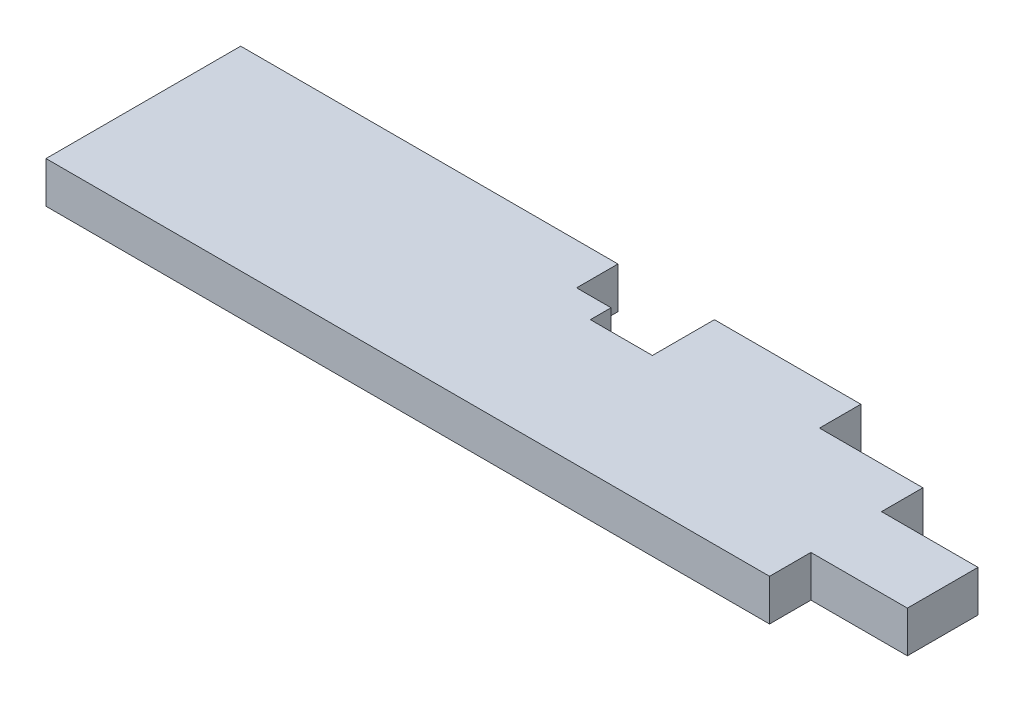
ISO-10303-21;
HEADER;
FILE_DESCRIPTION(('STEP AP214'),'2;1');
FILE_NAME('part.step','',(''),(''),'','','');
FILE_SCHEMA(('AUTOMOTIVE_DESIGN { 1 0 10303 214 1 1 1 1 }'));
ENDSEC;
DATA;
#1=APPLICATION_CONTEXT('core data for automotive mechanical design processes');
#2=APPLICATION_PROTOCOL_DEFINITION('international standard','automotive_design',2000,#1);
#3=PRODUCT_CONTEXT('',#1,'mechanical');
#4=PRODUCT('Part','Part','',(#3));
#5=PRODUCT_RELATED_PRODUCT_CATEGORY('part','',(#4));
#6=PRODUCT_DEFINITION_FORMATION('','',#4);
#7=PRODUCT_DEFINITION_CONTEXT('part definition',#1,'design');
#8=PRODUCT_DEFINITION('design','',#6,#7);
#9=PRODUCT_DEFINITION_SHAPE('','',#8);
#10=(LENGTH_UNIT() NAMED_UNIT(*) SI_UNIT(.MILLI.,.METRE.));
#11=(NAMED_UNIT(*) PLANE_ANGLE_UNIT() SI_UNIT($,.RADIAN.));
#12=(NAMED_UNIT(*) SI_UNIT($,.STERADIAN.) SOLID_ANGLE_UNIT());
#13=UNCERTAINTY_MEASURE_WITH_UNIT(LENGTH_MEASURE(1.E-05),#10,'distance_accuracy_value','');
#14=(GEOMETRIC_REPRESENTATION_CONTEXT(3) GLOBAL_UNCERTAINTY_ASSIGNED_CONTEXT((#13)) GLOBAL_UNIT_ASSIGNED_CONTEXT((#10,
#11,#12)) REPRESENTATION_CONTEXT('',''));
#15=CARTESIAN_POINT('',(0.,0.,0.));
#16=DIRECTION('',(0.,0.,1.));
#17=DIRECTION('',(1.,0.,0.));
#18=AXIS2_PLACEMENT_3D('',#15,#16,#17);
#19=CARTESIAN_POINT('',(0.,38.1,-179.3875));
#20=DIRECTION('',(0.,0.,1.));
#21=DIRECTION('',(1.,0.,0.));
#22=AXIS2_PLACEMENT_3D('',#19,#20,#21);
#23=PLANE('',#22);
#24=DIRECTION('',(0.,-1.,0.));
#25=VECTOR('',#24,1.);
#26=CARTESIAN_POINT('',(436.55104079,38.1,-179.3875));
#27=LINE('',#26,#25);
#28=CARTESIAN_POINT('',(436.55104079,38.1,-179.3875));
#29=VERTEX_POINT('',#28);
#30=CARTESIAN_POINT('',(436.55104079,0.,-179.3875));
#31=VERTEX_POINT('',#30);
#32=EDGE_CURVE('E245',#29,#31,#27,.T.);
#33=ORIENTED_EDGE('',*,*,#32,.F.);
#34=DIRECTION('',(-1.,0.,0.));
#35=VECTOR('',#34,1.);
#36=CARTESIAN_POINT('',(0.,38.1,-179.3875));
#37=LINE('',#36,#35);
#38=CARTESIAN_POINT('',(571.5,38.1,-179.3875));
#39=VERTEX_POINT('',#38);
#40=EDGE_CURVE('E202',#39,#29,#37,.T.);
#41=ORIENTED_EDGE('',*,*,#40,.F.);
#42=DIRECTION('',(0.,-1.,0.));
#43=VECTOR('',#42,1.);
#44=CARTESIAN_POINT('',(571.5,38.1,-179.3875));
#45=LINE('',#44,#43);
#46=CARTESIAN_POINT('',(571.5,0.,-179.3875));
#47=VERTEX_POINT('',#46);
#48=EDGE_CURVE('E186',#39,#47,#45,.T.);
#49=ORIENTED_EDGE('',*,*,#48,.T.);
#50=DIRECTION('',(-1.,0.,0.));
#51=VECTOR('',#50,1.);
#52=CARTESIAN_POINT('',(0.,0.,-179.3875));
#53=LINE('',#52,#51);
#54=EDGE_CURVE('E197',#47,#31,#53,.T.);
#55=ORIENTED_EDGE('',*,*,#54,.T.);
#56=EDGE_LOOP('',(#33,#41,#49,#55));
#57=FACE_BOUND('',#56,.T.);
#58=ADVANCED_FACE('F38',(#57),#23,.F.);
#59=DIRECTION('',(0.,-1.,0.));
#60=VECTOR('',#59,1.);
#61=CARTESIAN_POINT('',(347.662499999998,38.1,-179.3875));
#62=LINE('',#61,#60);
#63=CARTESIAN_POINT('',(347.662499999998,38.1,-179.3875));
#64=VERTEX_POINT('',#63);
#65=CARTESIAN_POINT('',(347.662499999998,0.,-179.3875));
#66=VERTEX_POINT('',#65);
#67=EDGE_CURVE('E242',#64,#66,#62,.T.);
#68=ORIENTED_EDGE('',*,*,#67,.T.);
#69=CARTESIAN_POINT('',(0.,0.,-179.3875));
#70=VERTEX_POINT('',#69);
#71=EDGE_CURVE('E212',#66,#70,#53,.T.);
#72=ORIENTED_EDGE('',*,*,#71,.T.);
#73=DIRECTION('',(0.,-1.,0.));
#74=VECTOR('',#73,1.);
#75=CARTESIAN_POINT('',(0.,38.1,-179.3875));
#76=LINE('',#75,#74);
#77=CARTESIAN_POINT('',(0.,38.1,-179.3875));
#78=VERTEX_POINT('',#77);
#79=EDGE_CURVE('E205',#78,#70,#76,.T.);
#80=ORIENTED_EDGE('',*,*,#79,.F.);
#81=EDGE_CURVE('E201',#64,#78,#37,.T.);
#82=ORIENTED_EDGE('',*,*,#81,.F.);
#83=EDGE_LOOP('',(#68,#72,#80,#82));
#84=FACE_BOUND('',#83,.T.);
#85=ADVANCED_FACE('F240',(#84),#23,.F.);
#86=CARTESIAN_POINT('',(0.,38.1,0.));
#87=DIRECTION('',(0.,-1.,0.));
#88=DIRECTION('',(0.,0.,-1.));
#89=AXIS2_PLACEMENT_3D('',#86,#87,#88);
#90=PLANE('',#89);
#91=DIRECTION('',(-1.,0.,0.));
#92=VECTOR('',#91,1.);
#93=CARTESIAN_POINT('',(755.65,38.1,-103.1875));
#94=LINE('',#93,#92);
#95=CARTESIAN_POINT('',(755.65,38.1,-103.1875));
#96=VERTEX_POINT('',#95);
#97=CARTESIAN_POINT('',(666.75,38.1,-103.1875));
#98=VERTEX_POINT('',#97);
#99=EDGE_CURVE('E150',#96,#98,#94,.T.);
#100=ORIENTED_EDGE('',*,*,#99,.T.);
#101=DIRECTION('',(0.,0.,-1.));
#102=VECTOR('',#101,1.);
#103=CARTESIAN_POINT('',(666.75,38.1,-141.2875));
#104=LINE('',#103,#102);
#105=CARTESIAN_POINT('',(666.75,38.1,-141.2875));
#106=VERTEX_POINT('',#105);
#107=EDGE_CURVE('E161',#98,#106,#104,.T.);
#108=ORIENTED_EDGE('',*,*,#107,.T.);
#109=DIRECTION('',(-1.,0.,0.));
#110=VECTOR('',#109,1.);
#111=CARTESIAN_POINT('',(755.65,38.1,-141.2875));
#112=LINE('',#111,#110);
#113=CARTESIAN_POINT('',(571.5,38.1,-141.2875));
#114=VERTEX_POINT('',#113);
#115=EDGE_CURVE('E258',#106,#114,#112,.T.);
#116=ORIENTED_EDGE('',*,*,#115,.T.);
#117=DIRECTION('',(0.,0.,-1.));
#118=VECTOR('',#117,1.);
#119=CARTESIAN_POINT('',(571.5,38.1,-179.3875));
#120=LINE('',#119,#118);
#121=EDGE_CURVE('E260',#114,#39,#120,.T.);
#122=ORIENTED_EDGE('',*,*,#121,.T.);
#123=ORIENTED_EDGE('',*,*,#40,.T.);
#124=DIRECTION('',(0.,0.,-1.));
#125=VECTOR('',#124,1.);
#126=CARTESIAN_POINT('',(436.55104079,38.1,4.24032385747234E-13));
#127=LINE('',#126,#125);
#128=CARTESIAN_POINT('',(436.55104079,38.1,-122.237499999995));
#129=VERTEX_POINT('',#128);
#130=EDGE_CURVE('E257',#129,#29,#127,.T.);
#131=ORIENTED_EDGE('',*,*,#130,.F.);
#132=DIRECTION('',(-1.,0.,0.));
#133=VECTOR('',#132,1.);
#134=CARTESIAN_POINT('',(0.,38.1,-122.237499999995));
#135=LINE('',#134,#133);
#136=CARTESIAN_POINT('',(379.412499999998,38.1,-122.237499999995));
#137=VERTEX_POINT('',#136);
#138=EDGE_CURVE('E295',#129,#137,#135,.T.);
#139=ORIENTED_EDGE('',*,*,#138,.T.);
#140=DIRECTION('',(0.,0.,-1.));
#141=VECTOR('',#140,1.);
#142=CARTESIAN_POINT('',(379.412499999998,38.1,0.));
#143=LINE('',#142,#141);
#144=CARTESIAN_POINT('',(379.412499999998,38.1,-141.287499999995));
#145=VERTEX_POINT('',#144);
#146=EDGE_CURVE('E297',#137,#145,#143,.T.);
#147=ORIENTED_EDGE('',*,*,#146,.T.);
#148=DIRECTION('',(-1.,0.,0.));
#149=VECTOR('',#148,1.);
#150=CARTESIAN_POINT('',(0.,38.1,-141.287499999995));
#151=LINE('',#150,#149);
#152=CARTESIAN_POINT('',(347.662499999998,38.1,-141.287499999995));
#153=VERTEX_POINT('',#152);
#154=EDGE_CURVE('E300',#145,#153,#151,.T.);
#155=ORIENTED_EDGE('',*,*,#154,.T.);
#156=DIRECTION('',(0.,0.,1.));
#157=VECTOR('',#156,1.);
#158=CARTESIAN_POINT('',(347.662499999998,38.1,5.06539254985153E-13));
#159=LINE('',#158,#157);
#160=EDGE_CURVE('E303',#64,#153,#159,.T.);
#161=ORIENTED_EDGE('',*,*,#160,.F.);
#162=ORIENTED_EDGE('',*,*,#81,.T.);
#163=DIRECTION('',(0.,0.,1.));
#164=VECTOR('',#163,1.);
#165=CARTESIAN_POINT('',(0.,38.1,0.));
#166=LINE('',#165,#164);
#167=CARTESIAN_POINT('',(0.,38.1,0.));
#168=VERTEX_POINT('',#167);
#169=EDGE_CURVE('E193',#78,#168,#166,.T.);
#170=ORIENTED_EDGE('',*,*,#169,.T.);
#171=DIRECTION('',(1.,0.,0.));
#172=VECTOR('',#171,1.);
#173=CARTESIAN_POINT('',(0.,38.1,0.));
#174=LINE('',#173,#172);
#175=CARTESIAN_POINT('',(666.75,38.1,0.));
#176=VERTEX_POINT('',#175);
#177=EDGE_CURVE('E196',#168,#176,#174,.T.);
#178=ORIENTED_EDGE('',*,*,#177,.T.);
#179=DIRECTION('',(0.,0.,-1.));
#180=VECTOR('',#179,1.);
#181=CARTESIAN_POINT('',(666.75,38.1,0.));
#182=LINE('',#181,#180);
#183=CARTESIAN_POINT('',(666.75,38.1,-38.1));
#184=VERTEX_POINT('',#183);
#185=EDGE_CURVE('E199',#176,#184,#182,.T.);
#186=ORIENTED_EDGE('',*,*,#185,.T.);
#187=DIRECTION('',(-1.,0.,0.));
#188=VECTOR('',#187,1.);
#189=CARTESIAN_POINT('',(666.75,38.1,-38.1));
#190=LINE('',#189,#188);
#191=CARTESIAN_POINT('',(755.65,38.1,-38.1));
#192=VERTEX_POINT('',#191);
#193=EDGE_CURVE('E175',#192,#184,#190,.T.);
#194=ORIENTED_EDGE('',*,*,#193,.F.);
#195=DIRECTION('',(0.,0.,1.));
#196=VECTOR('',#195,1.);
#197=CARTESIAN_POINT('',(755.65,38.1,-38.1));
#198=LINE('',#197,#196);
#199=EDGE_CURVE('E167',#96,#192,#198,.T.);
#200=ORIENTED_EDGE('',*,*,#199,.F.);
#201=EDGE_LOOP('',(#100,#108,#116,#122,#123,#131,#139,#147,#155,#161,#162,#170,#178,#186,#194,#200));
#202=FACE_BOUND('',#201,.T.);
#203=ADVANCED_FACE('F172',(#202),#90,.F.);
#204=CARTESIAN_POINT('',(0.,0.,0.));
#205=DIRECTION('',(0.,-1.,0.));
#206=DIRECTION('',(0.,0.,-1.));
#207=AXIS2_PLACEMENT_3D('',#204,#205,#206);
#208=PLANE('',#207);
#209=DIRECTION('',(0.,0.,-1.));
#210=VECTOR('',#209,1.);
#211=CARTESIAN_POINT('',(666.75,0.,-141.2875));
#212=LINE('',#211,#210);
#213=CARTESIAN_POINT('',(666.75,0.,-103.1875));
#214=VERTEX_POINT('',#213);
#215=CARTESIAN_POINT('',(666.75,0.,-141.2875));
#216=VERTEX_POINT('',#215);
#217=EDGE_CURVE('E53',#214,#216,#212,.T.);
#218=ORIENTED_EDGE('',*,*,#217,.F.);
#219=DIRECTION('',(-1.,0.,0.));
#220=VECTOR('',#219,1.);
#221=CARTESIAN_POINT('',(755.65,0.,-103.1875));
#222=LINE('',#221,#220);
#223=CARTESIAN_POINT('',(755.65,0.,-103.1875));
#224=VERTEX_POINT('',#223);
#225=EDGE_CURVE('E478',#224,#214,#222,.T.);
#226=ORIENTED_EDGE('',*,*,#225,.F.);
#227=DIRECTION('',(0.,0.,1.));
#228=VECTOR('',#227,1.);
#229=CARTESIAN_POINT('',(755.65,0.,-38.1));
#230=LINE('',#229,#228);
#231=CARTESIAN_POINT('',(755.65,0.,-38.1));
#232=VERTEX_POINT('',#231);
#233=EDGE_CURVE('E169',#224,#232,#230,.T.);
#234=ORIENTED_EDGE('',*,*,#233,.T.);
#235=DIRECTION('',(-1.,0.,0.));
#236=VECTOR('',#235,1.);
#237=CARTESIAN_POINT('',(666.75,0.,-38.1));
#238=LINE('',#237,#236);
#239=CARTESIAN_POINT('',(666.75,0.,-38.1));
#240=VERTEX_POINT('',#239);
#241=EDGE_CURVE('E176',#232,#240,#238,.T.);
#242=ORIENTED_EDGE('',*,*,#241,.T.);
#243=DIRECTION('',(0.,0.,-1.));
#244=VECTOR('',#243,1.);
#245=CARTESIAN_POINT('',(666.75,0.,0.));
#246=LINE('',#245,#244);
#247=CARTESIAN_POINT('',(666.75,0.,0.));
#248=VERTEX_POINT('',#247);
#249=EDGE_CURVE('E210',#248,#240,#246,.T.);
#250=ORIENTED_EDGE('',*,*,#249,.F.);
#251=DIRECTION('',(1.,0.,0.));
#252=VECTOR('',#251,1.);
#253=CARTESIAN_POINT('',(0.,0.,0.));
#254=LINE('',#253,#252);
#255=CARTESIAN_POINT('',(0.,0.,0.));
#256=VERTEX_POINT('',#255);
#257=EDGE_CURVE('E208',#256,#248,#254,.T.);
#258=ORIENTED_EDGE('',*,*,#257,.F.);
#259=DIRECTION('',(0.,0.,1.));
#260=VECTOR('',#259,1.);
#261=CARTESIAN_POINT('',(0.,0.,0.));
#262=LINE('',#261,#260);
#263=EDGE_CURVE('E191',#70,#256,#262,.T.);
#264=ORIENTED_EDGE('',*,*,#263,.F.);
#265=ORIENTED_EDGE('',*,*,#71,.F.);
#266=DIRECTION('',(0.,0.,1.));
#267=VECTOR('',#266,1.);
#268=CARTESIAN_POINT('',(347.662499999998,0.,5.06539254985153E-13));
#269=LINE('',#268,#267);
#270=CARTESIAN_POINT('',(347.662499999998,0.,-141.287499999995));
#271=VERTEX_POINT('',#270);
#272=EDGE_CURVE('E237',#66,#271,#269,.T.);
#273=ORIENTED_EDGE('',*,*,#272,.T.);
#274=DIRECTION('',(-1.,0.,0.));
#275=VECTOR('',#274,1.);
#276=CARTESIAN_POINT('',(0.,0.,-141.287499999995));
#277=LINE('',#276,#275);
#278=CARTESIAN_POINT('',(379.412499999998,0.,-141.287499999995));
#279=VERTEX_POINT('',#278);
#280=EDGE_CURVE('E308',#279,#271,#277,.T.);
#281=ORIENTED_EDGE('',*,*,#280,.F.);
#282=DIRECTION('',(0.,0.,-1.));
#283=VECTOR('',#282,1.);
#284=CARTESIAN_POINT('',(379.412499999998,0.,0.));
#285=LINE('',#284,#283);
#286=CARTESIAN_POINT('',(379.412499999998,0.,-122.237499999995));
#287=VERTEX_POINT('',#286);
#288=EDGE_CURVE('E289',#287,#279,#285,.T.);
#289=ORIENTED_EDGE('',*,*,#288,.F.);
#290=DIRECTION('',(-1.,0.,0.));
#291=VECTOR('',#290,1.);
#292=CARTESIAN_POINT('',(0.,0.,-122.237499999995));
#293=LINE('',#292,#291);
#294=CARTESIAN_POINT('',(436.55104079,0.,-122.237499999995));
#295=VERTEX_POINT('',#294);
#296=EDGE_CURVE('E61',#295,#287,#293,.T.);
#297=ORIENTED_EDGE('',*,*,#296,.F.);
#298=DIRECTION('',(0.,0.,-1.));
#299=VECTOR('',#298,1.);
#300=CARTESIAN_POINT('',(436.55104079,0.,4.24032385747234E-13));
#301=LINE('',#300,#299);
#302=EDGE_CURVE('E281',#295,#31,#301,.T.);
#303=ORIENTED_EDGE('',*,*,#302,.T.);
#304=ORIENTED_EDGE('',*,*,#54,.F.);
#305=DIRECTION('',(0.,0.,-1.));
#306=VECTOR('',#305,1.);
#307=CARTESIAN_POINT('',(571.5,0.,-179.3875));
#308=LINE('',#307,#306);
#309=CARTESIAN_POINT('',(571.5,0.,-141.2875));
#310=VERTEX_POINT('',#309);
#311=EDGE_CURVE('E261',#310,#47,#308,.T.);
#312=ORIENTED_EDGE('',*,*,#311,.F.);
#313=DIRECTION('',(-1.,0.,0.));
#314=VECTOR('',#313,1.);
#315=CARTESIAN_POINT('',(755.65,0.,-141.2875));
#316=LINE('',#315,#314);
#317=EDGE_CURVE('E264',#216,#310,#316,.T.);
#318=ORIENTED_EDGE('',*,*,#317,.F.);
#319=EDGE_LOOP('',(#218,#226,#234,#242,#250,#258,#264,#265,#273,#281,#289,#297,#303,#304,#312,#318));
#320=FACE_BOUND('',#319,.T.);
#321=ADVANCED_FACE('F224',(#320),#208,.T.);
#322=CARTESIAN_POINT('',(666.75,38.1,0.));
#323=DIRECTION('',(-1.,0.,0.));
#324=DIRECTION('',(0.,0.,1.));
#325=AXIS2_PLACEMENT_3D('',#322,#323,#324);
#326=PLANE('',#325);
#327=DIRECTION('',(0.,-1.,0.));
#328=VECTOR('',#327,1.);
#329=CARTESIAN_POINT('',(666.75,38.1,-38.1));
#330=LINE('',#329,#328);
#331=EDGE_CURVE('E188',#184,#240,#330,.T.);
#332=ORIENTED_EDGE('',*,*,#331,.F.);
#333=ORIENTED_EDGE('',*,*,#185,.F.);
#334=DIRECTION('',(0.,-1.,0.));
#335=VECTOR('',#334,1.);
#336=CARTESIAN_POINT('',(666.75,38.1,0.));
#337=LINE('',#336,#335);
#338=EDGE_CURVE('E46',#176,#248,#337,.T.);
#339=ORIENTED_EDGE('',*,*,#338,.T.);
#340=ORIENTED_EDGE('',*,*,#249,.T.);
#341=EDGE_LOOP('',(#332,#333,#339,#340));
#342=FACE_BOUND('',#341,.T.);
#343=ADVANCED_FACE('F221',(#342),#326,.F.);
#344=CARTESIAN_POINT('',(0.,38.1,0.));
#345=DIRECTION('',(1.,0.,0.));
#346=DIRECTION('',(0.,0.,-1.));
#347=AXIS2_PLACEMENT_3D('',#344,#345,#346);
#348=PLANE('',#347);
#349=ORIENTED_EDGE('',*,*,#263,.T.);
#350=DIRECTION('',(0.,-1.,0.));
#351=VECTOR('',#350,1.);
#352=CARTESIAN_POINT('',(0.,38.1,0.));
#353=LINE('',#352,#351);
#354=EDGE_CURVE('E11',#168,#256,#353,.T.);
#355=ORIENTED_EDGE('',*,*,#354,.F.);
#356=ORIENTED_EDGE('',*,*,#169,.F.);
#357=ORIENTED_EDGE('',*,*,#79,.T.);
#358=EDGE_LOOP('',(#349,#355,#356,#357));
#359=FACE_BOUND('',#358,.T.);
#360=ADVANCED_FACE('F40',(#359),#348,.F.);
#361=CARTESIAN_POINT('',(0.,38.1,0.));
#362=DIRECTION('',(0.,0.,-1.));
#363=DIRECTION('',(-1.,0.,0.));
#364=AXIS2_PLACEMENT_3D('',#361,#362,#363);
#365=PLANE('',#364);
#366=ORIENTED_EDGE('',*,*,#257,.T.);
#367=ORIENTED_EDGE('',*,*,#338,.F.);
#368=ORIENTED_EDGE('',*,*,#177,.F.);
#369=ORIENTED_EDGE('',*,*,#354,.T.);
#370=EDGE_LOOP('',(#366,#367,#368,#369));
#371=FACE_BOUND('',#370,.T.);
#372=ADVANCED_FACE('F231',(#371),#365,.F.);
#373=CARTESIAN_POINT('',(666.75,38.1,-38.1));
#374=DIRECTION('',(0.,0.,1.));
#375=DIRECTION('',(1.,0.,0.));
#376=AXIS2_PLACEMENT_3D('',#373,#374,#375);
#377=PLANE('',#376);
#378=ORIENTED_EDGE('',*,*,#241,.F.);
#379=DIRECTION('',(0.,-1.,0.));
#380=VECTOR('',#379,1.);
#381=CARTESIAN_POINT('',(755.65,38.1,-38.1));
#382=LINE('',#381,#380);
#383=EDGE_CURVE('E178',#192,#232,#382,.T.);
#384=ORIENTED_EDGE('',*,*,#383,.F.);
#385=ORIENTED_EDGE('',*,*,#193,.T.);
#386=ORIENTED_EDGE('',*,*,#331,.T.);
#387=EDGE_LOOP('',(#378,#384,#385,#386));
#388=FACE_BOUND('',#387,.T.);
#389=ADVANCED_FACE('F228',(#388),#377,.T.);
#390=CARTESIAN_POINT('',(755.65,38.1,-38.1));
#391=DIRECTION('',(1.,0.,0.));
#392=DIRECTION('',(0.,0.,-1.));
#393=AXIS2_PLACEMENT_3D('',#390,#391,#392);
#394=PLANE('',#393);
#395=DIRECTION('',(0.,-1.,0.));
#396=VECTOR('',#395,1.);
#397=CARTESIAN_POINT('',(755.65,38.1,-103.1875));
#398=LINE('',#397,#396);
#399=EDGE_CURVE('E154',#96,#224,#398,.T.);
#400=ORIENTED_EDGE('',*,*,#399,.F.);
#401=ORIENTED_EDGE('',*,*,#199,.T.);
#402=ORIENTED_EDGE('',*,*,#383,.T.);
#403=ORIENTED_EDGE('',*,*,#233,.F.);
#404=EDGE_LOOP('',(#400,#401,#402,#403));
#405=FACE_BOUND('',#404,.T.);
#406=ADVANCED_FACE('F165',(#405),#394,.T.);
#407=CARTESIAN_POINT('',(571.5,38.1,-179.3875));
#408=DIRECTION('',(-1.,0.,0.));
#409=DIRECTION('',(0.,0.,1.));
#410=AXIS2_PLACEMENT_3D('',#407,#408,#409);
#411=PLANE('',#410);
#412=ORIENTED_EDGE('',*,*,#311,.T.);
#413=ORIENTED_EDGE('',*,*,#48,.F.);
#414=ORIENTED_EDGE('',*,*,#121,.F.);
#415=DIRECTION('',(0.,-1.,0.));
#416=VECTOR('',#415,1.);
#417=CARTESIAN_POINT('',(571.5,38.1,-141.2875));
#418=LINE('',#417,#416);
#419=EDGE_CURVE('E183',#114,#310,#418,.T.);
#420=ORIENTED_EDGE('',*,*,#419,.T.);
#421=EDGE_LOOP('',(#412,#413,#414,#420));
#422=FACE_BOUND('',#421,.T.);
#423=ADVANCED_FACE('F275',(#422),#411,.F.);
#424=CARTESIAN_POINT('',(755.65,38.1,-141.2875));
#425=DIRECTION('',(0.,0.,1.));
#426=DIRECTION('',(1.,0.,0.));
#427=AXIS2_PLACEMENT_3D('',#424,#425,#426);
#428=PLANE('',#427);
#429=ORIENTED_EDGE('',*,*,#115,.F.);
#430=DIRECTION('',(0.,-1.,0.));
#431=VECTOR('',#430,1.);
#432=CARTESIAN_POINT('',(666.75,38.1,-141.2875));
#433=LINE('',#432,#431);
#434=EDGE_CURVE('E287',#106,#216,#433,.T.);
#435=ORIENTED_EDGE('',*,*,#434,.T.);
#436=ORIENTED_EDGE('',*,*,#317,.T.);
#437=ORIENTED_EDGE('',*,*,#419,.F.);
#438=EDGE_LOOP('',(#429,#435,#436,#437));
#439=FACE_BOUND('',#438,.T.);
#440=ADVANCED_FACE('F286',(#439),#428,.F.);
#441=CARTESIAN_POINT('',(0.,38.1,-122.237499999995));
#442=DIRECTION('',(0.,0.,1.));
#443=DIRECTION('',(1.,0.,0.));
#444=AXIS2_PLACEMENT_3D('',#441,#442,#443);
#445=PLANE('',#444);
#446=ORIENTED_EDGE('',*,*,#296,.T.);
#447=DIRECTION('',(0.,-1.,0.));
#448=VECTOR('',#447,1.);
#449=CARTESIAN_POINT('',(379.412499999998,38.1,-122.237499999995));
#450=LINE('',#449,#448);
#451=EDGE_CURVE('E255',#137,#287,#450,.T.);
#452=ORIENTED_EDGE('',*,*,#451,.F.);
#453=ORIENTED_EDGE('',*,*,#138,.F.);
#454=DIRECTION('',(0.,-1.,0.));
#455=VECTOR('',#454,1.);
#456=CARTESIAN_POINT('',(436.55104079,38.1,-122.237499999995));
#457=LINE('',#456,#455);
#458=EDGE_CURVE('E248',#129,#295,#457,.T.);
#459=ORIENTED_EDGE('',*,*,#458,.T.);
#460=EDGE_LOOP('',(#446,#452,#453,#459));
#461=FACE_BOUND('',#460,.T.);
#462=ADVANCED_FACE('F313',(#461),#445,.F.);
#463=CARTESIAN_POINT('',(436.55104079,38.1,4.24032385747234E-13));
#464=DIRECTION('',(-1.,0.,0.));
#465=DIRECTION('',(0.,0.,1.));
#466=AXIS2_PLACEMENT_3D('',#463,#464,#465);
#467=PLANE('',#466);
#468=ORIENTED_EDGE('',*,*,#302,.F.);
#469=ORIENTED_EDGE('',*,*,#458,.F.);
#470=ORIENTED_EDGE('',*,*,#130,.T.);
#471=ORIENTED_EDGE('',*,*,#32,.T.);
#472=EDGE_LOOP('',(#468,#469,#470,#471));
#473=FACE_BOUND('',#472,.T.);
#474=ADVANCED_FACE('F314',(#473),#467,.T.);
#475=CARTESIAN_POINT('',(347.662499999998,38.1,5.06539254985153E-13));
#476=DIRECTION('',(1.,0.,0.));
#477=DIRECTION('',(0.,0.,-1.));
#478=AXIS2_PLACEMENT_3D('',#475,#476,#477);
#479=PLANE('',#478);
#480=ORIENTED_EDGE('',*,*,#272,.F.);
#481=ORIENTED_EDGE('',*,*,#67,.F.);
#482=ORIENTED_EDGE('',*,*,#160,.T.);
#483=DIRECTION('',(0.,-1.,0.));
#484=VECTOR('',#483,1.);
#485=CARTESIAN_POINT('',(347.662499999998,38.1,-141.287499999995));
#486=LINE('',#485,#484);
#487=EDGE_CURVE('E246',#153,#271,#486,.T.);
#488=ORIENTED_EDGE('',*,*,#487,.T.);
#489=EDGE_LOOP('',(#480,#481,#482,#488));
#490=FACE_BOUND('',#489,.T.);
#491=ADVANCED_FACE('F323',(#490),#479,.T.);
#492=CARTESIAN_POINT('',(0.,38.1,-141.287499999995));
#493=DIRECTION('',(0.,0.,1.));
#494=DIRECTION('',(1.,0.,0.));
#495=AXIS2_PLACEMENT_3D('',#492,#493,#494);
#496=PLANE('',#495);
#497=ORIENTED_EDGE('',*,*,#280,.T.);
#498=ORIENTED_EDGE('',*,*,#487,.F.);
#499=ORIENTED_EDGE('',*,*,#154,.F.);
#500=DIRECTION('',(0.,-1.,0.));
#501=VECTOR('',#500,1.);
#502=CARTESIAN_POINT('',(379.412499999998,38.1,-141.287499999995));
#503=LINE('',#502,#501);
#504=EDGE_CURVE('E250',#145,#279,#503,.T.);
#505=ORIENTED_EDGE('',*,*,#504,.T.);
#506=EDGE_LOOP('',(#497,#498,#499,#505));
#507=FACE_BOUND('',#506,.T.);
#508=ADVANCED_FACE('F322',(#507),#496,.F.);
#509=CARTESIAN_POINT('',(379.412499999998,38.1,0.));
#510=DIRECTION('',(-1.,0.,0.));
#511=DIRECTION('',(0.,0.,1.));
#512=AXIS2_PLACEMENT_3D('',#509,#510,#511);
#513=PLANE('',#512);
#514=ORIENTED_EDGE('',*,*,#288,.T.);
#515=ORIENTED_EDGE('',*,*,#504,.F.);
#516=ORIENTED_EDGE('',*,*,#146,.F.);
#517=ORIENTED_EDGE('',*,*,#451,.T.);
#518=EDGE_LOOP('',(#514,#515,#516,#517));
#519=FACE_BOUND('',#518,.T.);
#520=ADVANCED_FACE('F317',(#519),#513,.F.);
#521=CARTESIAN_POINT('',(666.75,38.1,-141.2875));
#522=DIRECTION('',(-1.,0.,0.));
#523=DIRECTION('',(0.,0.,1.));
#524=AXIS2_PLACEMENT_3D('',#521,#522,#523);
#525=PLANE('',#524);
#526=ORIENTED_EDGE('',*,*,#217,.T.);
#527=ORIENTED_EDGE('',*,*,#434,.F.);
#528=ORIENTED_EDGE('',*,*,#107,.F.);
#529=DIRECTION('',(0.,-1.,0.));
#530=VECTOR('',#529,1.);
#531=CARTESIAN_POINT('',(666.75,38.1,-103.1875));
#532=LINE('',#531,#530);
#533=EDGE_CURVE('E156',#98,#214,#532,.T.);
#534=ORIENTED_EDGE('',*,*,#533,.T.);
#535=EDGE_LOOP('',(#526,#527,#528,#534));
#536=FACE_BOUND('',#535,.T.);
#537=ADVANCED_FACE('F456',(#536),#525,.F.);
#538=CARTESIAN_POINT('',(755.65,38.1,-103.1875));
#539=DIRECTION('',(0.,0.,1.));
#540=DIRECTION('',(1.,0.,0.));
#541=AXIS2_PLACEMENT_3D('',#538,#539,#540);
#542=PLANE('',#541);
#543=ORIENTED_EDGE('',*,*,#225,.T.);
#544=ORIENTED_EDGE('',*,*,#533,.F.);
#545=ORIENTED_EDGE('',*,*,#99,.F.);
#546=ORIENTED_EDGE('',*,*,#399,.T.);
#547=EDGE_LOOP('',(#543,#544,#545,#546));
#548=FACE_BOUND('',#547,.T.);
#549=ADVANCED_FACE('F153',(#548),#542,.F.);
#550=CLOSED_SHELL('',(#58,#85,#203,#321,#343,#360,#372,#389,#406,#423,#440,#462,#474,#491,#508,
#520,#537,#549));
#551=MANIFOLD_SOLID_BREP('B2',#550);
#552=ADVANCED_BREP_SHAPE_REPRESENTATION('',(#18,#551),#14);
#553=SHAPE_DEFINITION_REPRESENTATION(#9,#552);
ENDSEC;
END-ISO-10303-21;
